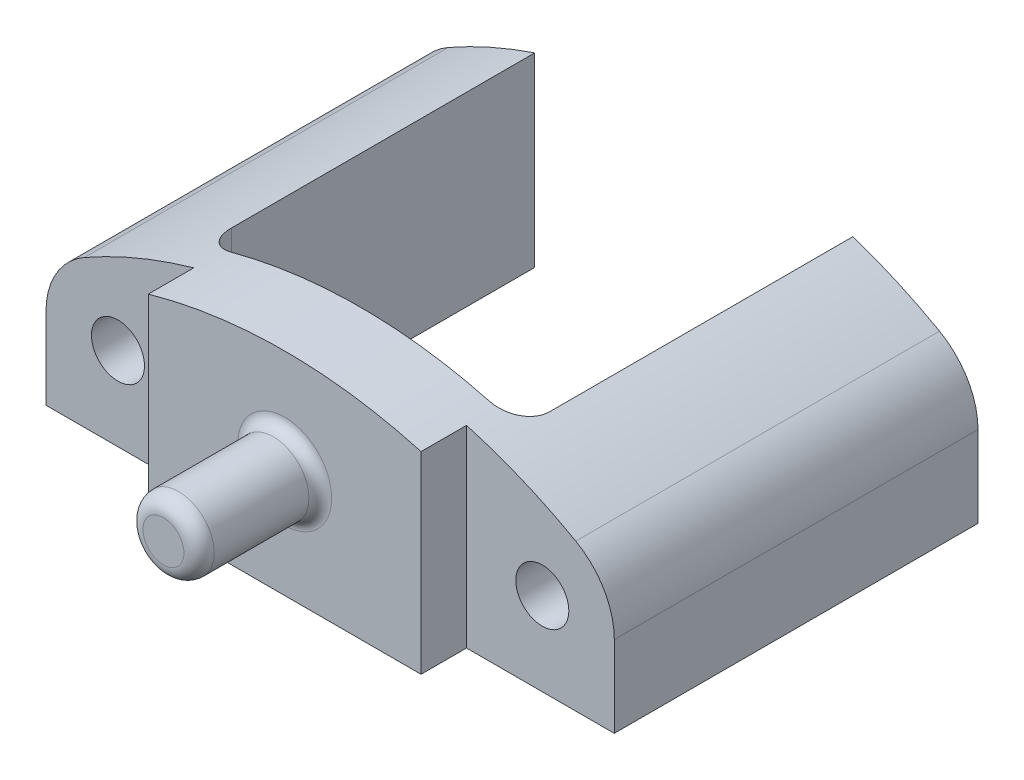
ISO-10303-21;
HEADER;
FILE_DESCRIPTION(('STEP AP214'),'2;1');
FILE_NAME('part.step','',(''),(''),'','','');
FILE_SCHEMA(('AUTOMOTIVE_DESIGN { 1 0 10303 214 1 1 1 1 }'));
ENDSEC;
DATA;
#1=APPLICATION_CONTEXT('core data for automotive mechanical design processes');
#2=APPLICATION_PROTOCOL_DEFINITION('international standard','automotive_design',2000,#1);
#3=PRODUCT_CONTEXT('',#1,'mechanical');
#4=PRODUCT('Part','Part','',(#3));
#5=PRODUCT_RELATED_PRODUCT_CATEGORY('part','',(#4));
#6=PRODUCT_DEFINITION_FORMATION('','',#4);
#7=PRODUCT_DEFINITION_CONTEXT('part definition',#1,'design');
#8=PRODUCT_DEFINITION('design','',#6,#7);
#9=PRODUCT_DEFINITION_SHAPE('','',#8);
#10=(LENGTH_UNIT() NAMED_UNIT(*) SI_UNIT(.MILLI.,.METRE.));
#11=(NAMED_UNIT(*) PLANE_ANGLE_UNIT() SI_UNIT($,.RADIAN.));
#12=(NAMED_UNIT(*) SI_UNIT($,.STERADIAN.) SOLID_ANGLE_UNIT());
#13=UNCERTAINTY_MEASURE_WITH_UNIT(LENGTH_MEASURE(1.E-05),#10,'distance_accuracy_value','');
#14=(GEOMETRIC_REPRESENTATION_CONTEXT(3) GLOBAL_UNCERTAINTY_ASSIGNED_CONTEXT((#13)) GLOBAL_UNIT_ASSIGNED_CONTEXT((#10,
#11,#12)) REPRESENTATION_CONTEXT('',''));
#15=CARTESIAN_POINT('',(0.,0.,0.));
#16=DIRECTION('',(0.,0.,1.));
#17=DIRECTION('',(1.,0.,0.));
#18=AXIS2_PLACEMENT_3D('',#15,#16,#17);
#19=CARTESIAN_POINT('',(0.,0.,0.));
#20=DIRECTION('',(0.,0.,1.));
#21=DIRECTION('',(1.,0.,0.));
#22=AXIS2_PLACEMENT_3D('',#19,#20,#21);
#23=PLANE('',#22);
#24=CARTESIAN_POINT('',(0.,33.1354096203632,0.));
#25=DIRECTION('',(0.,0.,1.));
#26=DIRECTION('',(1.,0.,0.));
#27=AXIS2_PLACEMENT_3D('',#24,#25,#26);
#28=CIRCLE('',#27,7.62);
#29=CARTESIAN_POINT('',(7.62,33.1354096203632,0.));
#30=VERTEX_POINT('',#29);
#31=EDGE_CURVE('E486',#30,#30,#28,.T.);
#32=ORIENTED_EDGE('',*,*,#31,.T.);
#33=EDGE_LOOP('',(#32));
#34=FACE_BOUND('',#33,.T.);
#35=CARTESIAN_POINT('',(0.,0.,0.));
#36=DIRECTION('',(0.,0.,1.));
#37=DIRECTION('',(1.,0.,0.));
#38=AXIS2_PLACEMENT_3D('',#35,#36,#37);
#39=CIRCLE('',#38,41.8353062799292);
#40=CARTESIAN_POINT('',(10.795,40.4185703178067,0.));
#41=VERTEX_POINT('',#40);
#42=CARTESIAN_POINT('',(-10.795,40.4185703178067,0.));
#43=VERTEX_POINT('',#42);
#44=EDGE_CURVE('E161',#41,#43,#39,.T.);
#45=ORIENTED_EDGE('',*,*,#44,.F.);
#46=DIRECTION('',(0.,1.,0.));
#47=VECTOR('',#46,1.);
#48=CARTESIAN_POINT('',(10.795,24.0793293678664,0.));
#49=LINE('',#48,#47);
#50=CARTESIAN_POINT('',(10.795,24.0793293678664,0.));
#51=VERTEX_POINT('',#50);
#52=EDGE_CURVE('E176',#41,#51,#49,.F.);
#53=ORIENTED_EDGE('',*,*,#52,.T.);
#54=DIRECTION('',(-1.,0.,0.));
#55=VECTOR('',#54,1.);
#56=CARTESIAN_POINT('',(0.,24.0793293678664,0.));
#57=LINE('',#56,#55);
#58=CARTESIAN_POINT('',(-10.795,24.0793293678664,0.));
#59=VERTEX_POINT('',#58);
#60=EDGE_CURVE('E450',#51,#59,#57,.T.);
#61=ORIENTED_EDGE('',*,*,#60,.T.);
#62=DIRECTION('',(0.,-1.,0.));
#63=VECTOR('',#62,1.);
#64=CARTESIAN_POINT('',(-10.795,41.7364588818937,0.));
#65=LINE('',#64,#63);
#66=EDGE_CURVE('E179',#59,#43,#65,.F.);
#67=ORIENTED_EDGE('',*,*,#66,.T.);
#68=EDGE_LOOP('',(#45,#53,#61,#67));
#69=FACE_BOUND('',#68,.T.);
#70=ADVANCED_FACE('F45',(#34,#69),#23,.F.);
#71=CARTESIAN_POINT('',(23.8125,0.,6.35));
#72=DIRECTION('',(1.,0.,0.));
#73=DIRECTION('',(0.,1.,0.));
#74=AXIS2_PLACEMENT_3D('',#71,#72,#73);
#75=PLANE('',#74);
#76=DIRECTION('',(0.,-1.,0.));
#77=VECTOR('',#76,1.);
#78=CARTESIAN_POINT('',(23.8125,36.7793293678664,-27.94));
#79=LINE('',#78,#77);
#80=CARTESIAN_POINT('',(23.8125,30.8912294273048,-27.94));
#81=VERTEX_POINT('',#80);
#82=CARTESIAN_POINT('',(23.8125,24.0793293678664,-27.94));
#83=VERTEX_POINT('',#82);
#84=EDGE_CURVE('E359',#81,#83,#79,.T.);
#85=ORIENTED_EDGE('',*,*,#84,.F.);
#86=DIRECTION('',(0.,0.,-1.));
#87=VECTOR('',#86,1.);
#88=CARTESIAN_POINT('',(23.8125,30.8912294273048,6.35));
#89=LINE('',#88,#87);
#90=CARTESIAN_POINT('',(23.8125,30.8912294273048,2.54));
#91=VERTEX_POINT('',#90);
#92=EDGE_CURVE('E170',#81,#91,#89,.F.);
#93=ORIENTED_EDGE('',*,*,#92,.T.);
#94=DIRECTION('',(0.,-1.,0.));
#95=VECTOR('',#94,1.);
#96=CARTESIAN_POINT('',(23.8125,0.,2.54));
#97=LINE('',#96,#95);
#98=CARTESIAN_POINT('',(23.8125,24.0793293678664,2.54));
#99=VERTEX_POINT('',#98);
#100=EDGE_CURVE('E379',#91,#99,#97,.T.);
#101=ORIENTED_EDGE('',*,*,#100,.T.);
#102=DIRECTION('',(0.,0.,-1.));
#103=VECTOR('',#102,1.);
#104=CARTESIAN_POINT('',(23.8125,24.0793293678664,6.35));
#105=LINE('',#104,#103);
#106=EDGE_CURVE('E368',#99,#83,#105,.T.);
#107=ORIENTED_EDGE('',*,*,#106,.T.);
#108=EDGE_LOOP('',(#85,#93,#101,#107));
#109=FACE_BOUND('',#108,.T.);
#110=ADVANCED_FACE('F260',(#109),#75,.T.);
#111=CARTESIAN_POINT('',(-23.8125,0.,6.35));
#112=DIRECTION('',(1.,0.,0.));
#113=DIRECTION('',(0.,0.,-1.));
#114=AXIS2_PLACEMENT_3D('',#111,#112,#113);
#115=PLANE('',#114);
#116=DIRECTION('',(0.,1.,0.));
#117=VECTOR('',#116,1.);
#118=CARTESIAN_POINT('',(-23.8125,0.,2.54));
#119=LINE('',#118,#117);
#120=CARTESIAN_POINT('',(-23.8125,24.0793293678664,2.54));
#121=VERTEX_POINT('',#120);
#122=CARTESIAN_POINT('',(-23.8125,30.8912294273048,2.54));
#123=VERTEX_POINT('',#122);
#124=EDGE_CURVE('E193',#121,#123,#119,.T.);
#125=ORIENTED_EDGE('',*,*,#124,.T.);
#126=DIRECTION('',(0.,0.,1.));
#127=VECTOR('',#126,1.);
#128=CARTESIAN_POINT('',(-23.8125,30.8912294273048,-27.94));
#129=LINE('',#128,#127);
#130=CARTESIAN_POINT('',(-23.8125,30.8912294273048,-27.94));
#131=VERTEX_POINT('',#130);
#132=EDGE_CURVE('E54',#123,#131,#129,.F.);
#133=ORIENTED_EDGE('',*,*,#132,.T.);
#134=DIRECTION('',(0.,1.,0.));
#135=VECTOR('',#134,1.);
#136=CARTESIAN_POINT('',(-23.8125,36.7793293678664,-27.94));
#137=LINE('',#136,#135);
#138=CARTESIAN_POINT('',(-23.8125,24.0793293678664,-27.94));
#139=VERTEX_POINT('',#138);
#140=EDGE_CURVE('E328',#139,#131,#137,.T.);
#141=ORIENTED_EDGE('',*,*,#140,.F.);
#142=DIRECTION('',(0.,0.,-1.));
#143=VECTOR('',#142,1.);
#144=CARTESIAN_POINT('',(-23.8125,24.0793293678664,6.35));
#145=LINE('',#144,#143);
#146=EDGE_CURVE('E455',#121,#139,#145,.T.);
#147=ORIENTED_EDGE('',*,*,#146,.F.);
#148=EDGE_LOOP('',(#125,#133,#141,#147));
#149=FACE_BOUND('',#148,.T.);
#150=ADVANCED_FACE('F263',(#149),#115,.F.);
#151=CARTESIAN_POINT('',(0.,0.,6.35));
#152=DIRECTION('',(0.,0.,1.));
#153=DIRECTION('',(1.,0.,0.));
#154=AXIS2_PLACEMENT_3D('',#151,#152,#153);
#155=PLANE('',#154);
#156=CARTESIAN_POINT('',(0.,33.0963293678664,6.35));
#157=DIRECTION('',(0.,0.,1.));
#158=DIRECTION('',(1.,0.,0.));
#159=AXIS2_PLACEMENT_3D('',#156,#157,#158);
#160=CIRCLE('',#159,3.937);
#161=CARTESIAN_POINT('',(3.937,33.0963293678664,6.35));
#162=VERTEX_POINT('',#161);
#163=EDGE_CURVE('E474',#162,#162,#160,.F.);
#164=ORIENTED_EDGE('',*,*,#163,.T.);
#165=EDGE_LOOP('',(#164));
#166=FACE_BOUND('',#165,.T.);
#167=DIRECTION('',(0.,-1.,0.));
#168=VECTOR('',#167,1.);
#169=CARTESIAN_POINT('',(11.43,0.,6.35));
#170=LINE('',#169,#168);
#171=CARTESIAN_POINT('',(11.43,40.2436075859941,6.35));
#172=VERTEX_POINT('',#171);
#173=CARTESIAN_POINT('',(11.43,24.0793293678664,6.35));
#174=VERTEX_POINT('',#173);
#175=EDGE_CURVE('E498',#172,#174,#170,.T.);
#176=ORIENTED_EDGE('',*,*,#175,.F.);
#177=CARTESIAN_POINT('',(0.,0.,6.35));
#178=DIRECTION('',(0.,0.,1.));
#179=DIRECTION('',(1.,0.,0.));
#180=AXIS2_PLACEMENT_3D('',#177,#178,#179);
#181=CIRCLE('',#180,41.8353062799292);
#182=CARTESIAN_POINT('',(-11.43,40.2436075859941,6.35));
#183=VERTEX_POINT('',#182);
#184=EDGE_CURVE('E388',#172,#183,#181,.T.);
#185=ORIENTED_EDGE('',*,*,#184,.T.);
#186=DIRECTION('',(0.,1.,0.));
#187=VECTOR('',#186,1.);
#188=CARTESIAN_POINT('',(-11.43,0.,6.35));
#189=LINE('',#188,#187);
#190=CARTESIAN_POINT('',(-11.43,24.0793293678664,6.35));
#191=VERTEX_POINT('',#190);
#192=EDGE_CURVE('E494',#191,#183,#189,.T.);
#193=ORIENTED_EDGE('',*,*,#192,.F.);
#194=DIRECTION('',(-1.,0.,0.));
#195=VECTOR('',#194,1.);
#196=CARTESIAN_POINT('',(0.,24.0793293678664,6.35));
#197=LINE('',#196,#195);
#198=EDGE_CURVE('E451',#174,#191,#197,.T.);
#199=ORIENTED_EDGE('',*,*,#198,.F.);
#200=EDGE_LOOP('',(#176,#185,#193,#199));
#201=FACE_BOUND('',#200,.T.);
#202=ADVANCED_FACE('F267',(#166,#201),#155,.T.);
#203=CARTESIAN_POINT('',(0.,0.,2.54));
#204=DIRECTION('',(0.,0.,-1.));
#205=DIRECTION('',(-1.,0.,0.));
#206=AXIS2_PLACEMENT_3D('',#203,#204,#205);
#207=PLANE('',#206);
#208=CARTESIAN_POINT('',(-17.78,31.0643293678664,2.54));
#209=DIRECTION('',(0.,0.,-1.));
#210=DIRECTION('',(-1.,0.,0.));
#211=AXIS2_PLACEMENT_3D('',#208,#209,#210);
#212=CIRCLE('',#211,2.2225);
#213=CARTESIAN_POINT('',(-20.0025,31.0643293678664,2.54));
#214=VERTEX_POINT('',#213);
#215=EDGE_CURVE('E446',#214,#214,#212,.F.);
#216=ORIENTED_EDGE('',*,*,#215,.F.);
#217=EDGE_LOOP('',(#216));
#218=FACE_BOUND('',#217,.T.);
#219=CARTESIAN_POINT('',(0.,0.,2.54));
#220=DIRECTION('',(0.,0.,-1.));
#221=DIRECTION('',(-1.,0.,0.));
#222=AXIS2_PLACEMENT_3D('',#219,#220,#221);
#223=CIRCLE('',#222,41.8353062799292);
#224=CARTESIAN_POINT('',(-20.587367350031,36.4191317459705,2.54));
#225=VERTEX_POINT('',#224);
#226=CARTESIAN_POINT('',(-11.43,40.2436075859941,2.54));
#227=VERTEX_POINT('',#226);
#228=EDGE_CURVE('E397',#225,#227,#223,.T.);
#229=ORIENTED_EDGE('',*,*,#228,.F.);
#230=CARTESIAN_POINT('',(-17.4625,30.8912294273048,2.54));
#231=DIRECTION('',(0.,0.,-1.));
#232=DIRECTION('',(-1.,0.,0.));
#233=AXIS2_PLACEMENT_3D('',#230,#231,#232);
#234=CIRCLE('',#233,6.35);
#235=EDGE_CURVE('E68',#225,#123,#234,.F.);
#236=ORIENTED_EDGE('',*,*,#235,.T.);
#237=ORIENTED_EDGE('',*,*,#124,.F.);
#238=DIRECTION('',(1.,0.,0.));
#239=VECTOR('',#238,1.);
#240=CARTESIAN_POINT('',(0.,24.0793293678664,2.54));
#241=LINE('',#240,#239);
#242=CARTESIAN_POINT('',(-11.43,24.0793293678664,2.54));
#243=VERTEX_POINT('',#242);
#244=EDGE_CURVE('E443',#121,#243,#241,.T.);
#245=ORIENTED_EDGE('',*,*,#244,.T.);
#246=DIRECTION('',(0.,1.,0.));
#247=VECTOR('',#246,1.);
#248=CARTESIAN_POINT('',(-11.43,43.002068019851,2.54));
#249=LINE('',#248,#247);
#250=EDGE_CURVE('E422',#243,#227,#249,.T.);
#251=ORIENTED_EDGE('',*,*,#250,.T.);
#252=EDGE_LOOP('',(#229,#236,#237,#245,#251));
#253=FACE_BOUND('',#252,.T.);
#254=ADVANCED_FACE('F280',(#218,#253),#207,.F.);
#255=CARTESIAN_POINT('',(-11.43,43.002068019851,2.54));
#256=DIRECTION('',(1.,0.,0.));
#257=DIRECTION('',(0.,0.,-1.));
#258=AXIS2_PLACEMENT_3D('',#255,#256,#257);
#259=PLANE('',#258);
#260=DIRECTION('',(0.,0.,-1.));
#261=VECTOR('',#260,1.);
#262=CARTESIAN_POINT('',(-11.43,40.2436075859941,16.51));
#263=LINE('',#262,#261);
#264=EDGE_CURVE('E394',#227,#183,#263,.F.);
#265=ORIENTED_EDGE('',*,*,#264,.F.);
#266=ORIENTED_EDGE('',*,*,#250,.F.);
#267=DIRECTION('',(0.,0.,1.));
#268=VECTOR('',#267,1.);
#269=CARTESIAN_POINT('',(-11.43,24.0793293678664,6.35));
#270=LINE('',#269,#268);
#271=EDGE_CURVE('E426',#243,#191,#270,.T.);
#272=ORIENTED_EDGE('',*,*,#271,.T.);
#273=ORIENTED_EDGE('',*,*,#192,.T.);
#274=EDGE_LOOP('',(#265,#266,#272,#273));
#275=FACE_BOUND('',#274,.T.);
#276=ADVANCED_FACE('F296',(#275),#259,.F.);
#277=CARTESIAN_POINT('',(11.43,31.0643293678664,2.54));
#278=DIRECTION('',(-1.,0.,0.));
#279=DIRECTION('',(0.,0.,1.));
#280=AXIS2_PLACEMENT_3D('',#277,#278,#279);
#281=PLANE('',#280);
#282=DIRECTION('',(0.,0.,-1.));
#283=VECTOR('',#282,1.);
#284=CARTESIAN_POINT('',(11.43,40.2436075859941,16.51));
#285=LINE('',#284,#283);
#286=CARTESIAN_POINT('',(11.43,40.2436075859941,2.54));
#287=VERTEX_POINT('',#286);
#288=EDGE_CURVE('E381',#172,#287,#285,.T.);
#289=ORIENTED_EDGE('',*,*,#288,.F.);
#290=ORIENTED_EDGE('',*,*,#175,.T.);
#291=DIRECTION('',(0.,0.,-1.));
#292=VECTOR('',#291,1.);
#293=CARTESIAN_POINT('',(11.43,24.0793293678664,6.35));
#294=LINE('',#293,#292);
#295=CARTESIAN_POINT('',(11.43,24.0793293678664,2.54));
#296=VERTEX_POINT('',#295);
#297=EDGE_CURVE('E432',#174,#296,#294,.T.);
#298=ORIENTED_EDGE('',*,*,#297,.T.);
#299=DIRECTION('',(0.,-1.,0.));
#300=VECTOR('',#299,1.);
#301=CARTESIAN_POINT('',(11.43,31.0643293678664,2.54));
#302=LINE('',#301,#300);
#303=EDGE_CURVE('E423',#287,#296,#302,.T.);
#304=ORIENTED_EDGE('',*,*,#303,.F.);
#305=EDGE_LOOP('',(#289,#290,#298,#304));
#306=FACE_BOUND('',#305,.T.);
#307=ADVANCED_FACE('F300',(#306),#281,.F.);
#308=CARTESIAN_POINT('',(0.,0.,2.54));
#309=DIRECTION('',(0.,0.,1.));
#310=DIRECTION('',(1.,0.,0.));
#311=AXIS2_PLACEMENT_3D('',#308,#309,#310);
#312=PLANE('',#311);
#313=CARTESIAN_POINT('',(17.78,31.0643293678664,2.54));
#314=DIRECTION('',(0.,0.,1.));
#315=DIRECTION('',(1.,0.,0.));
#316=AXIS2_PLACEMENT_3D('',#313,#314,#315);
#317=CIRCLE('',#316,2.2225);
#318=CARTESIAN_POINT('',(20.0025,31.0643293678664,2.54));
#319=VERTEX_POINT('',#318);
#320=EDGE_CURVE('E436',#319,#319,#317,.T.);
#321=ORIENTED_EDGE('',*,*,#320,.F.);
#322=EDGE_LOOP('',(#321));
#323=FACE_BOUND('',#322,.T.);
#324=ORIENTED_EDGE('',*,*,#100,.F.);
#325=CARTESIAN_POINT('',(17.4625,30.8912294273048,2.54));
#326=DIRECTION('',(0.,0.,1.));
#327=DIRECTION('',(1.,0.,0.));
#328=AXIS2_PLACEMENT_3D('',#325,#326,#327);
#329=CIRCLE('',#328,6.35);
#330=CARTESIAN_POINT('',(20.587367350031,36.4191317459706,2.54));
#331=VERTEX_POINT('',#330);
#332=EDGE_CURVE('E344',#91,#331,#329,.T.);
#333=ORIENTED_EDGE('',*,*,#332,.T.);
#334=CARTESIAN_POINT('',(0.,0.,2.54));
#335=DIRECTION('',(0.,0.,1.));
#336=DIRECTION('',(1.,0.,0.));
#337=AXIS2_PLACEMENT_3D('',#334,#335,#336);
#338=CIRCLE('',#337,41.8353062799292);
#339=EDGE_CURVE('E376',#331,#287,#338,.T.);
#340=ORIENTED_EDGE('',*,*,#339,.T.);
#341=ORIENTED_EDGE('',*,*,#303,.T.);
#342=DIRECTION('',(-1.,0.,0.));
#343=VECTOR('',#342,1.);
#344=CARTESIAN_POINT('',(0.,24.0793293678664,2.54));
#345=LINE('',#344,#343);
#346=EDGE_CURVE('E439',#99,#296,#345,.T.);
#347=ORIENTED_EDGE('',*,*,#346,.F.);
#348=EDGE_LOOP('',(#324,#333,#340,#341,#347));
#349=FACE_BOUND('',#348,.T.);
#350=ADVANCED_FACE('F304',(#323,#349),#312,.T.);
#351=CARTESIAN_POINT('',(0.,0.,-27.94));
#352=DIRECTION('',(0.,0.,-1.));
#353=DIRECTION('',(-1.,0.,0.));
#354=AXIS2_PLACEMENT_3D('',#351,#352,#353);
#355=PLANE('',#354);
#356=CARTESIAN_POINT('',(17.78,31.0643293678664,-27.94));
#357=DIRECTION('',(0.,0.,-1.));
#358=DIRECTION('',(-1.,0.,0.));
#359=AXIS2_PLACEMENT_3D('',#356,#357,#358);
#360=CIRCLE('',#359,2.22249999999999);
#361=CARTESIAN_POINT('',(15.5575,31.0643293678664,-27.94));
#362=VERTEX_POINT('',#361);
#363=EDGE_CURVE('E372',#362,#362,#360,.T.);
#364=ORIENTED_EDGE('',*,*,#363,.F.);
#365=EDGE_LOOP('',(#364));
#366=FACE_BOUND('',#365,.T.);
#367=CARTESIAN_POINT('',(0.,0.,-27.94));
#368=DIRECTION('',(0.,0.,-1.));
#369=DIRECTION('',(-1.,0.,0.));
#370=AXIS2_PLACEMENT_3D('',#367,#368,#369);
#371=CIRCLE('',#370,41.8353062799292);
#372=CARTESIAN_POINT('',(13.335,39.6531288366439,-27.94));
#373=VERTEX_POINT('',#372);
#374=CARTESIAN_POINT('',(20.587367350031,36.4191317459706,-27.94));
#375=VERTEX_POINT('',#374);
#376=EDGE_CURVE('E182',#373,#375,#371,.T.);
#377=ORIENTED_EDGE('',*,*,#376,.T.);
#378=CARTESIAN_POINT('',(17.4625,30.8912294273048,-27.94));
#379=DIRECTION('',(0.,0.,-1.));
#380=DIRECTION('',(-1.,0.,0.));
#381=AXIS2_PLACEMENT_3D('',#378,#379,#380);
#382=CIRCLE('',#381,6.35);
#383=EDGE_CURVE('E348',#375,#81,#382,.T.);
#384=ORIENTED_EDGE('',*,*,#383,.T.);
#385=ORIENTED_EDGE('',*,*,#84,.T.);
#386=DIRECTION('',(-1.,0.,0.));
#387=VECTOR('',#386,1.);
#388=CARTESIAN_POINT('',(23.8125,24.0793293678664,-27.94));
#389=LINE('',#388,#387);
#390=CARTESIAN_POINT('',(13.335,24.0793293678664,-27.94));
#391=VERTEX_POINT('',#390);
#392=EDGE_CURVE('E371',#83,#391,#389,.T.);
#393=ORIENTED_EDGE('',*,*,#392,.T.);
#394=DIRECTION('',(0.,1.,0.));
#395=VECTOR('',#394,1.);
#396=CARTESIAN_POINT('',(13.335,41.7364588818937,-27.94));
#397=LINE('',#396,#395);
#398=EDGE_CURVE('E415',#391,#373,#397,.T.);
#399=ORIENTED_EDGE('',*,*,#398,.T.);
#400=EDGE_LOOP('',(#377,#384,#385,#393,#399));
#401=FACE_BOUND('',#400,.T.);
#402=ADVANCED_FACE('F308',(#366,#401),#355,.T.);
#403=CARTESIAN_POINT('',(13.335,41.7364588818937,-27.94));
#404=DIRECTION('',(1.,0.,0.));
#405=DIRECTION('',(0.,0.,-1.));
#406=AXIS2_PLACEMENT_3D('',#403,#404,#405);
#407=PLANE('',#406);
#408=DIRECTION('',(0.,0.,-1.));
#409=VECTOR('',#408,1.);
#410=CARTESIAN_POINT('',(13.335,39.6531288366439,16.51));
#411=LINE('',#410,#409);
#412=CARTESIAN_POINT('',(13.335,39.6531288366439,-2.54));
#413=VERTEX_POINT('',#412);
#414=EDGE_CURVE('E164',#373,#413,#411,.F.);
#415=ORIENTED_EDGE('',*,*,#414,.F.);
#416=ORIENTED_EDGE('',*,*,#398,.F.);
#417=DIRECTION('',(0.,0.,1.));
#418=VECTOR('',#417,1.);
#419=CARTESIAN_POINT('',(13.335,24.0793293678664,-27.94));
#420=LINE('',#419,#418);
#421=CARTESIAN_POINT('',(13.335,24.0793293678664,-2.54));
#422=VERTEX_POINT('',#421);
#423=EDGE_CURVE('E418',#391,#422,#420,.T.);
#424=ORIENTED_EDGE('',*,*,#423,.T.);
#425=DIRECTION('',(0.,1.,0.));
#426=VECTOR('',#425,1.);
#427=CARTESIAN_POINT('',(13.335,41.7364588818937,-2.54));
#428=LINE('',#427,#426);
#429=EDGE_CURVE('E191',#422,#413,#428,.T.);
#430=ORIENTED_EDGE('',*,*,#429,.T.);
#431=EDGE_LOOP('',(#415,#416,#424,#430));
#432=FACE_BOUND('',#431,.T.);
#433=ADVANCED_FACE('F310',(#432),#407,.F.);
#434=CARTESIAN_POINT('',(0.,0.,-27.94));
#435=DIRECTION('',(0.,0.,1.));
#436=DIRECTION('',(1.,0.,0.));
#437=AXIS2_PLACEMENT_3D('',#434,#435,#436);
#438=PLANE('',#437);
#439=CARTESIAN_POINT('',(-17.78,31.0643293678664,-27.94));
#440=DIRECTION('',(0.,0.,-1.));
#441=DIRECTION('',(-1.,0.,0.));
#442=AXIS2_PLACEMENT_3D('',#439,#440,#441);
#443=CIRCLE('',#442,2.22249999999999);
#444=CARTESIAN_POINT('',(-20.0025,31.0643293678664,-27.94));
#445=VERTEX_POINT('',#444);
#446=EDGE_CURVE('E326',#445,#445,#443,.T.);
#447=ORIENTED_EDGE('',*,*,#446,.F.);
#448=EDGE_LOOP('',(#447));
#449=FACE_BOUND('',#448,.T.);
#450=ORIENTED_EDGE('',*,*,#140,.T.);
#451=CARTESIAN_POINT('',(-17.4625,30.8912294273048,-27.94));
#452=DIRECTION('',(0.,0.,1.));
#453=DIRECTION('',(1.,0.,0.));
#454=AXIS2_PLACEMENT_3D('',#451,#452,#453);
#455=CIRCLE('',#454,6.35);
#456=CARTESIAN_POINT('',(-20.587367350031,36.4191317459705,-27.94));
#457=VERTEX_POINT('',#456);
#458=EDGE_CURVE('E11',#131,#457,#455,.F.);
#459=ORIENTED_EDGE('',*,*,#458,.T.);
#460=CARTESIAN_POINT('',(0.,0.,-27.94));
#461=DIRECTION('',(0.,0.,1.));
#462=DIRECTION('',(1.,0.,0.));
#463=AXIS2_PLACEMENT_3D('',#460,#461,#462);
#464=CIRCLE('',#463,41.8353062799292);
#465=CARTESIAN_POINT('',(-13.335,39.6531288366439,-27.94));
#466=VERTEX_POINT('',#465);
#467=EDGE_CURVE('E384',#466,#457,#464,.T.);
#468=ORIENTED_EDGE('',*,*,#467,.F.);
#469=DIRECTION('',(0.,-1.,0.));
#470=VECTOR('',#469,1.);
#471=CARTESIAN_POINT('',(-13.335,41.7364588818937,-27.94));
#472=LINE('',#471,#470);
#473=CARTESIAN_POINT('',(-13.335,24.0793293678664,-27.94));
#474=VERTEX_POINT('',#473);
#475=EDGE_CURVE('E405',#466,#474,#472,.T.);
#476=ORIENTED_EDGE('',*,*,#475,.T.);
#477=DIRECTION('',(-1.,0.,0.));
#478=VECTOR('',#477,1.);
#479=CARTESIAN_POINT('',(-23.8125,24.0793293678664,-27.94));
#480=LINE('',#479,#478);
#481=EDGE_CURVE('E333',#474,#139,#480,.T.);
#482=ORIENTED_EDGE('',*,*,#481,.T.);
#483=EDGE_LOOP('',(#450,#459,#468,#476,#482));
#484=FACE_BOUND('',#483,.T.);
#485=ADVANCED_FACE('F313',(#449,#484),#438,.F.);
#486=CARTESIAN_POINT('',(-13.335,41.7364588818937,-27.94));
#487=DIRECTION('',(-1.,0.,0.));
#488=DIRECTION('',(0.,-1.,0.));
#489=AXIS2_PLACEMENT_3D('',#486,#487,#488);
#490=PLANE('',#489);
#491=DIRECTION('',(0.,0.,-1.));
#492=VECTOR('',#491,1.);
#493=CARTESIAN_POINT('',(-13.335,39.6531288366439,16.51));
#494=LINE('',#493,#492);
#495=CARTESIAN_POINT('',(-13.335,39.6531288366439,-2.54));
#496=VERTEX_POINT('',#495);
#497=EDGE_CURVE('E228',#496,#466,#494,.T.);
#498=ORIENTED_EDGE('',*,*,#497,.F.);
#499=DIRECTION('',(0.,-1.,0.));
#500=VECTOR('',#499,1.);
#501=CARTESIAN_POINT('',(-13.335,24.0793293678664,-2.54));
#502=LINE('',#501,#500);
#503=CARTESIAN_POINT('',(-13.335,24.0793293678664,-2.54));
#504=VERTEX_POINT('',#503);
#505=EDGE_CURVE('E187',#496,#504,#502,.T.);
#506=ORIENTED_EDGE('',*,*,#505,.T.);
#507=DIRECTION('',(0.,0.,1.));
#508=VECTOR('',#507,1.);
#509=CARTESIAN_POINT('',(-13.335,24.0793293678664,-27.94));
#510=LINE('',#509,#508);
#511=EDGE_CURVE('E336',#474,#504,#510,.T.);
#512=ORIENTED_EDGE('',*,*,#511,.F.);
#513=ORIENTED_EDGE('',*,*,#475,.F.);
#514=EDGE_LOOP('',(#498,#506,#512,#513));
#515=FACE_BOUND('',#514,.T.);
#516=ADVANCED_FACE('F218',(#515),#490,.F.);
#517=CARTESIAN_POINT('',(-10.795,41.7364588818937,-2.54));
#518=DIRECTION('',(0.,1.,0.));
#519=DIRECTION('',(-1.,0.,0.));
#520=AXIS2_PLACEMENT_3D('',#517,#518,#519);
#521=CYLINDRICAL_SURFACE('',#520,2.54);
#522=CARTESIAN_POINT('',(-10.795,40.4185703178067,0.));
#523=CARTESIAN_POINT('',(-10.8690419455638,40.3987963884839,-1.84937912421181E-06));
#524=CARTESIAN_POINT('',(-10.9429918130391,40.3788263943488,-0.00323925295502093));
#525=CARTESIAN_POINT('',(-11.0902544016922,40.3386281454504,-0.0161350157327842));
#526=CARTESIAN_POINT('',(-11.1635671588059,40.3183999054142,-0.0257930103717171));
#527=CARTESIAN_POINT('',(-11.3817431761984,40.2575641699206,-0.0642985404261823));
#528=CARTESIAN_POINT('',(-11.5249881501856,40.2167671602683,-0.102677829269442));
#529=CARTESIAN_POINT('',(-11.8028654858461,40.1360962046172,-0.203826096491058));
#530=CARTESIAN_POINT('',(-11.9374939714668,40.0962226791153,-0.266605962685676));
#531=CARTESIAN_POINT('',(-12.1942770752918,40.0188759749675,-0.415007974625929));
#532=CARTESIAN_POINT('',(-12.3164349185184,39.9814021766692,-0.500624193884135));
#533=CARTESIAN_POINT('',(-12.5435261933575,39.9107359862602,-0.69173435713077));
#534=CARTESIAN_POINT('',(-12.6486048598683,39.8775080704715,-0.797042309894756));
#535=CARTESIAN_POINT('',(-12.839407612803,39.8164855949314,-1.02536674558881));
#536=CARTESIAN_POINT('',(-12.9251311145169,39.7886911993273,-1.14838376331723));
#537=CARTESIAN_POINT('',(-13.0711176476651,39.7409665634749,-1.40349339396954));
#538=CARTESIAN_POINT('',(-13.1322477738065,39.7207705245934,-1.53504044071154));
#539=CARTESIAN_POINT('',(-13.2313501260034,39.6878695079645,-1.80738560451641));
#540=CARTESIAN_POINT('',(-13.2693534253925,39.6751544794559,-1.94817102565211));
#541=CARTESIAN_POINT('',(-13.3083326582582,39.662089082353,-2.1652529611404));
#542=CARTESIAN_POINT('',(-13.3183270257073,39.6587328676414,-2.23986108887838));
#543=CARTESIAN_POINT('',(-13.3316575748638,39.6542529985062,-2.38963268508443));
#544=CARTESIAN_POINT('',(-13.3350028719085,39.6531262876227,-2.46479525128478));
#545=CARTESIAN_POINT('',(-13.335,39.6531288366439,-2.54));
#546=B_SPLINE_CURVE_WITH_KNOTS('',3,(#522,#523,#524,#525,#526,#527,#528,#529,#530,#531,#532,
#533,#534,#535,#536,#537,#538,#539,#540,#541,#542,#543,#544,#545),.UNSPECIFIED.,.F.,.F.,(4,2,2,
2,2,2,2,2,2,2,2,4),(0.,0.229766905853157,0.459520766592102,0.918587072223056,1.3778584540854,
1.83701076167074,2.29202733754037,2.74705765739826,3.18423207786165,3.6208178039177,
3.84657635583152,4.07202519698042),.UNSPECIFIED.);
#547=EDGE_CURVE('E181',#43,#496,#546,.T.);
#548=ORIENTED_EDGE('',*,*,#547,.F.);
#549=ORIENTED_EDGE('',*,*,#66,.F.);
#550=CARTESIAN_POINT('',(-10.795,24.0793293678664,-2.54));
#551=DIRECTION('',(0.,-1.,0.));
#552=DIRECTION('',(1.,0.,0.));
#553=AXIS2_PLACEMENT_3D('',#550,#551,#552);
#554=CIRCLE('',#553,2.54);
#555=EDGE_CURVE('E199',#504,#59,#554,.F.);
#556=ORIENTED_EDGE('',*,*,#555,.F.);
#557=ORIENTED_EDGE('',*,*,#505,.F.);
#558=EDGE_LOOP('',(#548,#549,#556,#557));
#559=FACE_BOUND('',#558,.T.);
#560=ADVANCED_FACE('F231',(#559),#521,.F.);
#561=CARTESIAN_POINT('',(10.795,41.7364588818937,-2.54));
#562=DIRECTION('',(0.,-1.,0.));
#563=DIRECTION('',(0.,0.,-1.));
#564=AXIS2_PLACEMENT_3D('',#561,#562,#563);
#565=CYLINDRICAL_SURFACE('',#564,2.54);
#566=CARTESIAN_POINT('',(13.335,39.6531288366439,-2.54));
#567=CARTESIAN_POINT('',(13.3350087468653,39.6531245173133,-2.47109813905413));
#568=CARTESIAN_POINT('',(13.3321965259458,39.6540715856672,-2.4022009649116));
#569=CARTESIAN_POINT('',(13.3209975583484,39.6578357880408,-2.26492415230127));
#570=CARTESIAN_POINT('',(13.3126117727104,39.6606525996639,-2.19654442666623));
#571=CARTESIAN_POINT('',(13.2903589273718,39.668114919484,-2.06094430797234));
#572=CARTESIAN_POINT('',(13.2765046499369,39.6727561630794,-1.99372159017155));
#573=CARTESIAN_POINT('',(13.2434572338969,39.6838001371076,-1.8607679757163));
#574=CARTESIAN_POINT('',(13.2242640283539,39.6902028896256,-1.79503709777726));
#575=CARTESIAN_POINT('',(13.1589146323395,39.71193716254,-1.60078567982485));
#576=CARTESIAN_POINT('',(13.104965439964,39.7298025797211,-1.47506654656872));
#577=CARTESIAN_POINT('',(12.9781755875181,39.7713996770045,-1.23468373453119));
#578=CARTESIAN_POINT('',(12.905329351305,39.7951330885384,-1.12002333268485));
#579=CARTESIAN_POINT('',(12.7409877132028,39.8480576475049,-0.901757858837563));
#580=CARTESIAN_POINT('',(12.649078054242,39.8773685706258,-0.798493660787589));
#581=CARTESIAN_POINT('',(12.450466835804,39.9398241415813,-0.608701597136087));
#582=CARTESIAN_POINT('',(12.3437608243947,39.9729699427565,-0.522178787528558));
#583=CARTESIAN_POINT('',(12.1130242199195,40.0435102404677,-0.364017927715688));
#584=CARTESIAN_POINT('',(11.9884092447855,40.0810321028897,-0.293289297874406));
#585=CARTESIAN_POINT('',(11.7294798773056,40.1575692170172,-0.173849563306781));
#586=CARTESIAN_POINT('',(11.5951670258263,40.1965842310195,-0.12513496972497));
#587=CARTESIAN_POINT('',(11.3499003242282,40.2664274102843,-0.0588339094540627));
#588=CARTESIAN_POINT('',(11.240111230991,40.2972176883243,-0.0368131768569153));
#589=CARTESIAN_POINT('',(11.0186045828115,40.358352336403,-0.00739303121956055));
#590=CARTESIAN_POINT('',(10.9068893059016,40.3886971638398,2.25989027406225E-05));
#591=CARTESIAN_POINT('',(10.795,40.4185703178066,0.));
#592=B_SPLINE_CURVE_WITH_KNOTS('',3,(#566,#567,#568,#569,#570,#571,#572,#573,#574,#575,#576,
#577,#578,#579,#580,#581,#582,#583,#584,#585,#586,#587,#588,#589,#590,#591),.UNSPECIFIED.,.F.,
.F.,(4,2,2,2,2,2,2,2,2,2,2,2,4),(0.,0.206633633653228,0.413231647081459,0.619349583117686,
0.82547010351565,1.23729068381661,1.64923292270337,2.07129721780176,2.4934887804309,
2.93586544046657,3.37817196661348,3.72566193431169,4.07276584121094),.UNSPECIFIED.);
#593=EDGE_CURVE('E157',#413,#41,#592,.T.);
#594=ORIENTED_EDGE('',*,*,#593,.F.);
#595=ORIENTED_EDGE('',*,*,#429,.F.);
#596=CARTESIAN_POINT('',(10.795,24.0793293678664,-2.54));
#597=DIRECTION('',(0.,-1.,0.));
#598=DIRECTION('',(1.,0.,0.));
#599=AXIS2_PLACEMENT_3D('',#596,#597,#598);
#600=CIRCLE('',#599,2.54);
#601=EDGE_CURVE('E171',#51,#422,#600,.F.);
#602=ORIENTED_EDGE('',*,*,#601,.F.);
#603=ORIENTED_EDGE('',*,*,#52,.F.);
#604=EDGE_LOOP('',(#594,#595,#602,#603));
#605=FACE_BOUND('',#604,.T.);
#606=ADVANCED_FACE('F185',(#605),#565,.F.);
#607=CARTESIAN_POINT('',(17.78,31.0643293678664,6.35));
#608=DIRECTION('',(0.,0.,-1.));
#609=DIRECTION('',(-1.,0.,0.));
#610=AXIS2_PLACEMENT_3D('',#607,#608,#609);
#611=CYLINDRICAL_SURFACE('',#610,2.2225);
#612=ORIENTED_EDGE('',*,*,#320,.T.);
#613=EDGE_LOOP('',(#612));
#614=FACE_BOUND('',#613,.T.);
#615=ORIENTED_EDGE('',*,*,#363,.T.);
#616=EDGE_LOOP('',(#615));
#617=FACE_BOUND('',#616,.T.);
#618=ADVANCED_FACE('F258',(#614,#617),#611,.F.);
#619=CARTESIAN_POINT('',(0.,24.0793293678664,6.35));
#620=DIRECTION('',(0.,-1.,0.));
#621=DIRECTION('',(1.,0.,0.));
#622=AXIS2_PLACEMENT_3D('',#619,#620,#621);
#623=PLANE('',#622);
#624=ORIENTED_EDGE('',*,*,#297,.F.);
#625=ORIENTED_EDGE('',*,*,#198,.T.);
#626=ORIENTED_EDGE('',*,*,#271,.F.);
#627=ORIENTED_EDGE('',*,*,#244,.F.);
#628=ORIENTED_EDGE('',*,*,#146,.T.);
#629=ORIENTED_EDGE('',*,*,#481,.F.);
#630=ORIENTED_EDGE('',*,*,#511,.T.);
#631=ORIENTED_EDGE('',*,*,#555,.T.);
#632=ORIENTED_EDGE('',*,*,#60,.F.);
#633=ORIENTED_EDGE('',*,*,#601,.T.);
#634=ORIENTED_EDGE('',*,*,#423,.F.);
#635=ORIENTED_EDGE('',*,*,#392,.F.);
#636=ORIENTED_EDGE('',*,*,#106,.F.);
#637=ORIENTED_EDGE('',*,*,#346,.T.);
#638=EDGE_LOOP('',(#624,#625,#626,#627,#628,#629,#630,#631,#632,#633,#634,#635,#636,#637));
#639=FACE_BOUND('',#638,.T.);
#640=ADVANCED_FACE('F254',(#639),#623,.T.);
#641=CARTESIAN_POINT('',(-17.78,31.0643293678664,6.35));
#642=DIRECTION('',(0.,0.,-1.));
#643=DIRECTION('',(-1.,0.,0.));
#644=AXIS2_PLACEMENT_3D('',#641,#642,#643);
#645=CYLINDRICAL_SURFACE('',#644,2.2225);
#646=ORIENTED_EDGE('',*,*,#215,.T.);
#647=EDGE_LOOP('',(#646));
#648=FACE_BOUND('',#647,.T.);
#649=ORIENTED_EDGE('',*,*,#446,.T.);
#650=EDGE_LOOP('',(#649));
#651=FACE_BOUND('',#650,.T.);
#652=ADVANCED_FACE('F257',(#648,#651),#645,.F.);
#653=CARTESIAN_POINT('',(0.,33.0963293678664,16.51));
#654=DIRECTION('',(0.,0.,-1.));
#655=DIRECTION('',(-1.,0.,0.));
#656=AXIS2_PLACEMENT_3D('',#653,#654,#655);
#657=CYLINDRICAL_SURFACE('',#656,2.9845);
#658=CARTESIAN_POINT('',(0.,33.0963293678664,7.3025));
#659=DIRECTION('',(0.,0.,1.));
#660=DIRECTION('',(1.,0.,0.));
#661=AXIS2_PLACEMENT_3D('',#658,#659,#660);
#662=CIRCLE('',#661,2.9845);
#663=CARTESIAN_POINT('',(2.9845,33.0963293678664,7.3025));
#664=VERTEX_POINT('',#663);
#665=EDGE_CURVE('E470',#664,#664,#662,.T.);
#666=ORIENTED_EDGE('',*,*,#665,.T.);
#667=EDGE_LOOP('',(#666));
#668=FACE_BOUND('',#667,.T.);
#669=CARTESIAN_POINT('',(0.,33.0963293678664,15.24));
#670=DIRECTION('',(0.,0.,1.));
#671=DIRECTION('',(1.,0.,0.));
#672=AXIS2_PLACEMENT_3D('',#669,#670,#671);
#673=CIRCLE('',#672,2.9845);
#674=CARTESIAN_POINT('',(2.9845,33.0963293678664,15.24));
#675=VERTEX_POINT('',#674);
#676=EDGE_CURVE('E466',#675,#675,#673,.F.);
#677=ORIENTED_EDGE('',*,*,#676,.T.);
#678=EDGE_LOOP('',(#677));
#679=FACE_BOUND('',#678,.T.);
#680=ADVANCED_FACE('F270',(#668,#679),#657,.T.);
#681=CARTESIAN_POINT('',(0.,33.0963293678664,16.51));
#682=DIRECTION('',(0.,0.,1.));
#683=DIRECTION('',(1.,0.,0.));
#684=AXIS2_PLACEMENT_3D('',#681,#682,#683);
#685=PLANE('',#684);
#686=CARTESIAN_POINT('',(0.,33.0963293678664,16.51));
#687=DIRECTION('',(0.,0.,1.));
#688=DIRECTION('',(1.,0.,0.));
#689=AXIS2_PLACEMENT_3D('',#686,#687,#688);
#690=CIRCLE('',#689,1.7145);
#691=CARTESIAN_POINT('',(1.7145,33.0963293678664,16.51));
#692=VERTEX_POINT('',#691);
#693=EDGE_CURVE('E462',#692,#692,#690,.T.);
#694=ORIENTED_EDGE('',*,*,#693,.T.);
#695=EDGE_LOOP('',(#694));
#696=FACE_BOUND('',#695,.T.);
#697=ADVANCED_FACE('F252',(#696),#685,.T.);
#698=CARTESIAN_POINT('',(0.,33.0963293678664,15.24));
#699=DIRECTION('',(0.,0.,1.));
#700=DIRECTION('',(1.,0.,0.));
#701=AXIS2_PLACEMENT_3D('',#698,#699,#700);
#702=TOROIDAL_SURFACE('',#701,1.7145,1.27);
#703=ORIENTED_EDGE('',*,*,#676,.F.);
#704=EDGE_LOOP('',(#703));
#705=FACE_BOUND('',#704,.T.);
#706=ORIENTED_EDGE('',*,*,#693,.F.);
#707=EDGE_LOOP('',(#706));
#708=FACE_BOUND('',#707,.T.);
#709=ADVANCED_FACE('F248',(#705,#708),#702,.T.);
#710=CARTESIAN_POINT('',(0.,33.0963293678664,7.3025));
#711=DIRECTION('',(0.,0.,1.));
#712=DIRECTION('',(1.,0.,0.));
#713=AXIS2_PLACEMENT_3D('',#710,#711,#712);
#714=TOROIDAL_SURFACE('',#713,3.937,0.9525);
#715=ORIENTED_EDGE('',*,*,#163,.F.);
#716=EDGE_LOOP('',(#715));
#717=FACE_BOUND('',#716,.T.);
#718=ORIENTED_EDGE('',*,*,#665,.F.);
#719=EDGE_LOOP('',(#718));
#720=FACE_BOUND('',#719,.T.);
#721=ADVANCED_FACE('F244',(#717,#720),#714,.F.);
#722=CARTESIAN_POINT('',(0.,33.1354096203632,4.445));
#723=DIRECTION('',(0.,0.,-1.));
#724=DIRECTION('',(-1.,0.,0.));
#725=AXIS2_PLACEMENT_3D('',#722,#723,#724);
#726=CYLINDRICAL_SURFACE('',#725,6.35);
#727=CARTESIAN_POINT('',(0.,33.1354096203632,1.27));
#728=DIRECTION('',(0.,0.,1.));
#729=DIRECTION('',(1.,0.,0.));
#730=AXIS2_PLACEMENT_3D('',#727,#728,#729);
#731=CIRCLE('',#730,6.35);
#732=CARTESIAN_POINT('',(6.35,33.1354096203632,1.27));
#733=VERTEX_POINT('',#732);
#734=EDGE_CURVE('E482',#733,#733,#731,.F.);
#735=ORIENTED_EDGE('',*,*,#734,.T.);
#736=EDGE_LOOP('',(#735));
#737=FACE_BOUND('',#736,.T.);
#738=CARTESIAN_POINT('',(0.,33.1354096203632,3.175));
#739=DIRECTION('',(0.,0.,-1.));
#740=DIRECTION('',(-1.,0.,0.));
#741=AXIS2_PLACEMENT_3D('',#738,#739,#740);
#742=CIRCLE('',#741,6.35);
#743=CARTESIAN_POINT('',(-6.35,33.1354096203632,3.175));
#744=VERTEX_POINT('',#743);
#745=EDGE_CURVE('E478',#744,#744,#742,.F.);
#746=ORIENTED_EDGE('',*,*,#745,.T.);
#747=EDGE_LOOP('',(#746));
#748=FACE_BOUND('',#747,.T.);
#749=ADVANCED_FACE('F247',(#737,#748),#726,.F.);
#750=CARTESIAN_POINT('',(0.,33.1354096203632,4.445));
#751=DIRECTION('',(0.,0.,-1.));
#752=DIRECTION('',(-1.,0.,0.));
#753=AXIS2_PLACEMENT_3D('',#750,#751,#752);
#754=PLANE('',#753);
#755=CARTESIAN_POINT('',(0.,33.1354096203632,4.445));
#756=DIRECTION('',(0.,0.,-1.));
#757=DIRECTION('',(-1.,0.,0.));
#758=AXIS2_PLACEMENT_3D('',#755,#756,#757);
#759=CIRCLE('',#758,5.08);
#760=CARTESIAN_POINT('',(-5.08,33.1354096203632,4.445));
#761=VERTEX_POINT('',#760);
#762=EDGE_CURVE('E490',#761,#761,#759,.T.);
#763=ORIENTED_EDGE('',*,*,#762,.T.);
#764=EDGE_LOOP('',(#763));
#765=FACE_BOUND('',#764,.T.);
#766=ADVANCED_FACE('F242',(#765),#754,.T.);
#767=CARTESIAN_POINT('',(0.,33.1354096203632,1.27));
#768=DIRECTION('',(0.,0.,1.));
#769=DIRECTION('',(1.,0.,0.));
#770=AXIS2_PLACEMENT_3D('',#767,#768,#769);
#771=TOROIDAL_SURFACE('',#770,7.62,1.27);
#772=ORIENTED_EDGE('',*,*,#31,.F.);
#773=EDGE_LOOP('',(#772));
#774=FACE_BOUND('',#773,.T.);
#775=ORIENTED_EDGE('',*,*,#734,.F.);
#776=EDGE_LOOP('',(#775));
#777=FACE_BOUND('',#776,.T.);
#778=ADVANCED_FACE('F238',(#774,#777),#771,.T.);
#779=CARTESIAN_POINT('',(0.,33.1354096203632,3.175));
#780=DIRECTION('',(0.,0.,-1.));
#781=DIRECTION('',(-1.,0.,0.));
#782=AXIS2_PLACEMENT_3D('',#779,#780,#781);
#783=TOROIDAL_SURFACE('',#782,5.08,1.27);
#784=ORIENTED_EDGE('',*,*,#745,.F.);
#785=EDGE_LOOP('',(#784));
#786=FACE_BOUND('',#785,.T.);
#787=ORIENTED_EDGE('',*,*,#762,.F.);
#788=EDGE_LOOP('',(#787));
#789=FACE_BOUND('',#788,.T.);
#790=ADVANCED_FACE('F217',(#786,#789),#783,.F.);
#791=CARTESIAN_POINT('',(0.,0.,16.51));
#792=DIRECTION('',(0.,0.,-1.));
#793=DIRECTION('',(-1.,0.,0.));
#794=AXIS2_PLACEMENT_3D('',#791,#792,#793);
#795=CYLINDRICAL_SURFACE('',#794,41.8353062799292);
#796=ORIENTED_EDGE('',*,*,#339,.F.);
#797=DIRECTION('',(0.,0.,-1.));
#798=VECTOR('',#797,1.);
#799=CARTESIAN_POINT('',(20.587367350031,36.4191317459706,16.51));
#800=LINE('',#799,#798);
#801=EDGE_CURVE('E343',#331,#375,#800,.T.);
#802=ORIENTED_EDGE('',*,*,#801,.T.);
#803=ORIENTED_EDGE('',*,*,#376,.F.);
#804=ORIENTED_EDGE('',*,*,#414,.T.);
#805=ORIENTED_EDGE('',*,*,#593,.T.);
#806=ORIENTED_EDGE('',*,*,#44,.T.);
#807=ORIENTED_EDGE('',*,*,#547,.T.);
#808=ORIENTED_EDGE('',*,*,#497,.T.);
#809=ORIENTED_EDGE('',*,*,#467,.T.);
#810=DIRECTION('',(0.,0.,-1.));
#811=VECTOR('',#810,1.);
#812=CARTESIAN_POINT('',(-20.587367350031,36.4191317459706,16.51));
#813=LINE('',#812,#811);
#814=EDGE_CURVE('E341',#457,#225,#813,.F.);
#815=ORIENTED_EDGE('',*,*,#814,.T.);
#816=ORIENTED_EDGE('',*,*,#228,.T.);
#817=ORIENTED_EDGE('',*,*,#264,.T.);
#818=ORIENTED_EDGE('',*,*,#184,.F.);
#819=ORIENTED_EDGE('',*,*,#288,.T.);
#820=EDGE_LOOP('',(#796,#802,#803,#804,#805,#806,#807,#808,#809,#815,#816,#817,#818,#819));
#821=FACE_BOUND('',#820,.T.);
#822=ADVANCED_FACE('F160',(#821),#795,.T.);
#823=CARTESIAN_POINT('',(17.4625,30.8912294273048,16.51));
#824=DIRECTION('',(0.,0.,-1.));
#825=DIRECTION('',(-1.,0.,0.));
#826=AXIS2_PLACEMENT_3D('',#823,#824,#825);
#827=CYLINDRICAL_SURFACE('',#826,6.35);
#828=ORIENTED_EDGE('',*,*,#383,.F.);
#829=ORIENTED_EDGE('',*,*,#801,.F.);
#830=ORIENTED_EDGE('',*,*,#332,.F.);
#831=ORIENTED_EDGE('',*,*,#92,.F.);
#832=EDGE_LOOP('',(#828,#829,#830,#831));
#833=FACE_BOUND('',#832,.T.);
#834=ADVANCED_FACE('F216',(#833),#827,.T.);
#835=CARTESIAN_POINT('',(-17.4625,30.8912294273048,16.51));
#836=DIRECTION('',(0.,0.,-1.));
#837=DIRECTION('',(-1.,0.,0.));
#838=AXIS2_PLACEMENT_3D('',#835,#836,#837);
#839=CYLINDRICAL_SURFACE('',#838,6.35);
#840=ORIENTED_EDGE('',*,*,#458,.F.);
#841=ORIENTED_EDGE('',*,*,#132,.F.);
#842=ORIENTED_EDGE('',*,*,#235,.F.);
#843=ORIENTED_EDGE('',*,*,#814,.F.);
#844=EDGE_LOOP('',(#840,#841,#842,#843));
#845=FACE_BOUND('',#844,.T.);
#846=ADVANCED_FACE('F47',(#845),#839,.T.);
#847=CLOSED_SHELL('',(#70,#110,#150,#202,#254,#276,#307,#350,#402,#433,#485,#516,#560,#606,#618,
#640,#652,#680,#697,#709,#721,#749,#766,#778,#790,#822,#834,#846));
#848=MANIFOLD_SOLID_BREP('B2',#847);
#849=ADVANCED_BREP_SHAPE_REPRESENTATION('',(#18,#848),#14);
#850=SHAPE_DEFINITION_REPRESENTATION(#9,#849);
ENDSEC;
END-ISO-10303-21;
